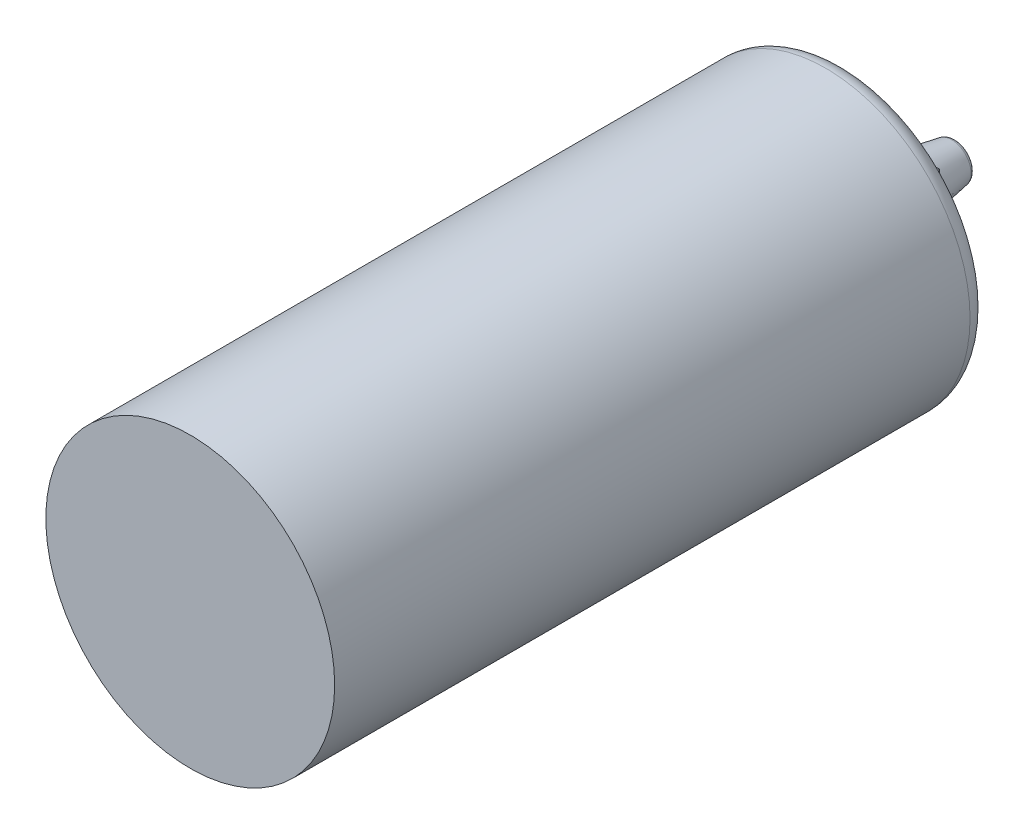
ISO-10303-21;
HEADER;
FILE_DESCRIPTION(('STEP AP214'),'2;1');
FILE_NAME('part.step','',(''),(''),'','','');
FILE_SCHEMA(('AUTOMOTIVE_DESIGN { 1 0 10303 214 1 1 1 1 }'));
ENDSEC;
DATA;
#1=APPLICATION_CONTEXT('core data for automotive mechanical design processes');
#2=APPLICATION_PROTOCOL_DEFINITION('international standard','automotive_design',2000,#1);
#3=PRODUCT_CONTEXT('',#1,'mechanical');
#4=PRODUCT('Part','Part','',(#3));
#5=PRODUCT_RELATED_PRODUCT_CATEGORY('part','',(#4));
#6=PRODUCT_DEFINITION_FORMATION('','',#4);
#7=PRODUCT_DEFINITION_CONTEXT('part definition',#1,'design');
#8=PRODUCT_DEFINITION('design','',#6,#7);
#9=PRODUCT_DEFINITION_SHAPE('','',#8);
#10=(LENGTH_UNIT() NAMED_UNIT(*) SI_UNIT(.MILLI.,.METRE.));
#11=(NAMED_UNIT(*) PLANE_ANGLE_UNIT() SI_UNIT($,.RADIAN.));
#12=(NAMED_UNIT(*) SI_UNIT($,.STERADIAN.) SOLID_ANGLE_UNIT());
#13=UNCERTAINTY_MEASURE_WITH_UNIT(LENGTH_MEASURE(1.E-05),#10,'distance_accuracy_value','');
#14=(GEOMETRIC_REPRESENTATION_CONTEXT(3) GLOBAL_UNCERTAINTY_ASSIGNED_CONTEXT((#13)) GLOBAL_UNIT_ASSIGNED_CONTEXT((#10,
#11,#12)) REPRESENTATION_CONTEXT('',''));
#15=CARTESIAN_POINT('',(0.,0.,0.));
#16=DIRECTION('',(0.,0.,1.));
#17=DIRECTION('',(1.,0.,0.));
#18=AXIS2_PLACEMENT_3D('',#15,#16,#17);
#19=CARTESIAN_POINT('',(0.,0.,-1.27));
#20=DIRECTION('',(0.,0.,1.));
#21=DIRECTION('',(1.,0.,0.));
#22=AXIS2_PLACEMENT_3D('',#19,#20,#21);
#23=PLANE('',#22);
#24=CARTESIAN_POINT('',(5.715,-5.715,-1.27));
#25=DIRECTION('',(0.,0.,1.));
#26=DIRECTION('',(1.,0.,0.));
#27=AXIS2_PLACEMENT_3D('',#24,#25,#26);
#28=CIRCLE('',#27,3.81);
#29=CARTESIAN_POINT('',(9.525,-5.715,-1.27));
#30=VERTEX_POINT('',#29);
#31=EDGE_CURVE('E146',#30,#30,#28,.F.);
#32=ORIENTED_EDGE('',*,*,#31,.F.);
#33=EDGE_LOOP('',(#32));
#34=FACE_BOUND('',#33,.T.);
#35=CARTESIAN_POINT('',(5.715,5.715,-1.27));
#36=DIRECTION('',(0.,0.,1.));
#37=DIRECTION('',(1.,0.,0.));
#38=AXIS2_PLACEMENT_3D('',#35,#36,#37);
#39=CIRCLE('',#38,3.81);
#40=CARTESIAN_POINT('',(9.525,5.715,-1.27));
#41=VERTEX_POINT('',#40);
#42=EDGE_CURVE('E140',#41,#41,#39,.F.);
#43=ORIENTED_EDGE('',*,*,#42,.F.);
#44=EDGE_LOOP('',(#43));
#45=FACE_BOUND('',#44,.T.);
#46=DIRECTION('',(0.,-1.,0.));
#47=VECTOR('',#46,1.);
#48=CARTESIAN_POINT('',(-11.2060647345003,0.,-1.27));
#49=LINE('',#48,#47);
#50=CARTESIAN_POINT('',(-11.2060647345003,-11.2060647345002,-1.27));
#51=VERTEX_POINT('',#50);
#52=CARTESIAN_POINT('',(-11.2060647345003,11.2060647345003,-1.27));
#53=VERTEX_POINT('',#52);
#54=EDGE_CURVE('E111',#51,#53,#49,.F.);
#55=ORIENTED_EDGE('',*,*,#54,.T.);
#56=DIRECTION('',(-1.,0.,0.));
#57=VECTOR('',#56,1.);
#58=CARTESIAN_POINT('',(0.,11.2060647345003,-1.27));
#59=LINE('',#58,#57);
#60=CARTESIAN_POINT('',(11.2060647345002,11.2060647345003,-1.27));
#61=VERTEX_POINT('',#60);
#62=EDGE_CURVE('E127',#53,#61,#59,.F.);
#63=ORIENTED_EDGE('',*,*,#62,.T.);
#64=DIRECTION('',(0.,1.,0.));
#65=VECTOR('',#64,1.);
#66=CARTESIAN_POINT('',(11.2060647345002,0.,-1.27));
#67=LINE('',#66,#65);
#68=CARTESIAN_POINT('',(11.2060647345002,-11.2060647345002,-1.27));
#69=VERTEX_POINT('',#68);
#70=EDGE_CURVE('E129',#61,#69,#67,.F.);
#71=ORIENTED_EDGE('',*,*,#70,.T.);
#72=DIRECTION('',(1.,0.,0.));
#73=VECTOR('',#72,1.);
#74=CARTESIAN_POINT('',(0.,-11.2060647345002,-1.27));
#75=LINE('',#74,#73);
#76=EDGE_CURVE('E120',#69,#51,#75,.F.);
#77=ORIENTED_EDGE('',*,*,#76,.T.);
#78=EDGE_LOOP('',(#55,#63,#71,#77));
#79=FACE_BOUND('',#78,.T.);
#80=CARTESIAN_POINT('',(-5.715,5.715,-1.27));
#81=DIRECTION('',(0.,0.,1.));
#82=DIRECTION('',(1.,0.,0.));
#83=AXIS2_PLACEMENT_3D('',#80,#81,#82);
#84=CIRCLE('',#83,3.81);
#85=CARTESIAN_POINT('',(-1.905,5.715,-1.27));
#86=VERTEX_POINT('',#85);
#87=EDGE_CURVE('E143',#86,#86,#84,.F.);
#88=ORIENTED_EDGE('',*,*,#87,.F.);
#89=EDGE_LOOP('',(#88));
#90=FACE_BOUND('',#89,.T.);
#91=CARTESIAN_POINT('',(-5.715,-5.715,-1.27));
#92=DIRECTION('',(0.,0.,1.));
#93=DIRECTION('',(1.,0.,0.));
#94=AXIS2_PLACEMENT_3D('',#91,#92,#93);
#95=CIRCLE('',#94,3.81);
#96=CARTESIAN_POINT('',(-1.905,-5.715,-1.27));
#97=VERTEX_POINT('',#96);
#98=EDGE_CURVE('E149',#97,#97,#95,.F.);
#99=ORIENTED_EDGE('',*,*,#98,.F.);
#100=EDGE_LOOP('',(#99));
#101=FACE_BOUND('',#100,.T.);
#102=ADVANCED_FACE('F34',(#34,#45,#79,#90,#101),#23,.F.);
#103=CARTESIAN_POINT('',(0.,0.,0.));
#104=DIRECTION('',(0.,0.,1.));
#105=DIRECTION('',(1.,0.,0.));
#106=AXIS2_PLACEMENT_3D('',#103,#104,#105);
#107=PLANE('',#106);
#108=CARTESIAN_POINT('',(0.,0.,0.));
#109=DIRECTION('',(0.,0.,1.));
#110=DIRECTION('',(1.,0.,0.));
#111=AXIS2_PLACEMENT_3D('',#108,#109,#110);
#112=CIRCLE('',#111,16.51);
#113=CARTESIAN_POINT('',(16.51,0.,0.));
#114=VERTEX_POINT('',#113);
#115=EDGE_CURVE('E137',#114,#114,#112,.F.);
#116=ORIENTED_EDGE('',*,*,#115,.T.);
#117=EDGE_LOOP('',(#116));
#118=FACE_BOUND('',#117,.T.);
#119=DIRECTION('',(0.,1.,0.));
#120=VECTOR('',#119,1.);
#121=CARTESIAN_POINT('',(-11.43,-11.43,0.));
#122=LINE('',#121,#120);
#123=CARTESIAN_POINT('',(-11.43,-11.43,0.));
#124=VERTEX_POINT('',#123);
#125=CARTESIAN_POINT('',(-11.43,11.43,0.));
#126=VERTEX_POINT('',#125);
#127=EDGE_CURVE('E103',#124,#126,#122,.T.);
#128=ORIENTED_EDGE('',*,*,#127,.F.);
#129=DIRECTION('',(-1.,0.,0.));
#130=VECTOR('',#129,1.);
#131=CARTESIAN_POINT('',(11.43,-11.43,0.));
#132=LINE('',#131,#130);
#133=CARTESIAN_POINT('',(11.43,-11.43,0.));
#134=VERTEX_POINT('',#133);
#135=EDGE_CURVE('E108',#134,#124,#132,.T.);
#136=ORIENTED_EDGE('',*,*,#135,.F.);
#137=DIRECTION('',(0.,-1.,0.));
#138=VECTOR('',#137,1.);
#139=CARTESIAN_POINT('',(11.43,-11.43,0.));
#140=LINE('',#139,#138);
#141=CARTESIAN_POINT('',(11.43,11.43,0.));
#142=VERTEX_POINT('',#141);
#143=EDGE_CURVE('E54',#142,#134,#140,.T.);
#144=ORIENTED_EDGE('',*,*,#143,.F.);
#145=DIRECTION('',(1.,0.,0.));
#146=VECTOR('',#145,1.);
#147=CARTESIAN_POINT('',(11.43,11.43,0.));
#148=LINE('',#147,#146);
#149=EDGE_CURVE('E49',#126,#142,#148,.T.);
#150=ORIENTED_EDGE('',*,*,#149,.F.);
#151=EDGE_LOOP('',(#128,#136,#144,#150));
#152=FACE_BOUND('',#151,.T.);
#153=ADVANCED_FACE('F189',(#118,#152),#107,.F.);
#154=CARTESIAN_POINT('',(0.,0.,86.36));
#155=DIRECTION('',(0.,0.,-1.));
#156=DIRECTION('',(-1.,0.,0.));
#157=AXIS2_PLACEMENT_3D('',#154,#155,#156);
#158=CYLINDRICAL_SURFACE('',#157,19.05);
#159=CARTESIAN_POINT('',(0.,0.,2.54));
#160=DIRECTION('',(0.,0.,1.));
#161=DIRECTION('',(1.,0.,0.));
#162=AXIS2_PLACEMENT_3D('',#159,#160,#161);
#163=CIRCLE('',#162,19.05);
#164=CARTESIAN_POINT('',(19.05,0.,2.54));
#165=VERTEX_POINT('',#164);
#166=EDGE_CURVE('E134',#165,#165,#163,.T.);
#167=ORIENTED_EDGE('',*,*,#166,.T.);
#168=EDGE_LOOP('',(#167));
#169=FACE_BOUND('',#168,.T.);
#170=CARTESIAN_POINT('',(0.,0.,86.36));
#171=DIRECTION('',(0.,0.,1.));
#172=DIRECTION('',(1.,0.,0.));
#173=AXIS2_PLACEMENT_3D('',#170,#171,#172);
#174=CIRCLE('',#173,19.05);
#175=CARTESIAN_POINT('',(19.05,0.,86.36));
#176=VERTEX_POINT('',#175);
#177=EDGE_CURVE('E114',#176,#176,#174,.T.);
#178=ORIENTED_EDGE('',*,*,#177,.F.);
#179=EDGE_LOOP('',(#178));
#180=FACE_BOUND('',#179,.T.);
#181=ADVANCED_FACE('F195',(#169,#180),#158,.T.);
#182=CARTESIAN_POINT('',(0.,0.,86.36));
#183=DIRECTION('',(0.,0.,1.));
#184=DIRECTION('',(1.,0.,0.));
#185=AXIS2_PLACEMENT_3D('',#182,#183,#184);
#186=PLANE('',#185);
#187=ORIENTED_EDGE('',*,*,#177,.T.);
#188=EDGE_LOOP('',(#187));
#189=FACE_BOUND('',#188,.T.);
#190=ADVANCED_FACE('F208',(#189),#186,.T.);
#191=CARTESIAN_POINT('',(-11.43,-11.43,0.));
#192=DIRECTION('',(-0.984807753012208,0.,-0.173648177666931));
#193=DIRECTION('',(-0.173648177666931,0.,0.984807753012208));
#194=AXIS2_PLACEMENT_3D('',#191,#192,#193);
#195=PLANE('',#194);
#196=ORIENTED_EDGE('',*,*,#127,.T.);
#197=DIRECTION('',(-0.171087869746036,0.171087869746036,0.970287525247814));
#198=VECTOR('',#197,1.);
#199=CARTESIAN_POINT('',(-10.760863587277,10.760863587277,-3.79486117232042));
#200=LINE('',#199,#198);
#201=EDGE_CURVE('E112',#53,#126,#200,.T.);
#202=ORIENTED_EDGE('',*,*,#201,.F.);
#203=ORIENTED_EDGE('',*,*,#54,.F.);
#204=DIRECTION('',(-0.171087869746036,-0.171087869746036,0.970287525247814));
#205=VECTOR('',#204,1.);
#206=CARTESIAN_POINT('',(-11.43,-11.43,0.));
#207=LINE('',#206,#205);
#208=EDGE_CURVE('E116',#51,#124,#207,.T.);
#209=ORIENTED_EDGE('',*,*,#208,.T.);
#210=EDGE_LOOP('',(#196,#202,#203,#209));
#211=FACE_BOUND('',#210,.T.);
#212=ADVANCED_FACE('F204',(#211),#195,.T.);
#213=CARTESIAN_POINT('',(11.43,11.43,0.));
#214=DIRECTION('',(0.,0.984807753012208,-0.173648177666931));
#215=DIRECTION('',(0.,0.173648177666931,0.984807753012208));
#216=AXIS2_PLACEMENT_3D('',#213,#214,#215);
#217=PLANE('',#216);
#218=ORIENTED_EDGE('',*,*,#149,.T.);
#219=DIRECTION('',(0.171087869746036,0.171087869746036,0.970287525247814));
#220=VECTOR('',#219,1.);
#221=CARTESIAN_POINT('',(10.7608635872769,10.760863587277,-3.79486117232042));
#222=LINE('',#221,#220);
#223=EDGE_CURVE('E115',#61,#142,#222,.T.);
#224=ORIENTED_EDGE('',*,*,#223,.F.);
#225=ORIENTED_EDGE('',*,*,#62,.F.);
#226=ORIENTED_EDGE('',*,*,#201,.T.);
#227=EDGE_LOOP('',(#218,#224,#225,#226));
#228=FACE_BOUND('',#227,.T.);
#229=ADVANCED_FACE('F207',(#228),#217,.T.);
#230=CARTESIAN_POINT('',(11.43,-11.43,0.));
#231=DIRECTION('',(0.984807753012208,0.,-0.173648177666931));
#232=DIRECTION('',(-0.173648177666931,0.,-0.984807753012208));
#233=AXIS2_PLACEMENT_3D('',#230,#231,#232);
#234=PLANE('',#233);
#235=ORIENTED_EDGE('',*,*,#143,.T.);
#236=DIRECTION('',(0.171087869746036,-0.171087869746036,0.970287525247814));
#237=VECTOR('',#236,1.);
#238=CARTESIAN_POINT('',(11.43,-11.43,0.));
#239=LINE('',#238,#237);
#240=EDGE_CURVE('E119',#69,#134,#239,.T.);
#241=ORIENTED_EDGE('',*,*,#240,.F.);
#242=ORIENTED_EDGE('',*,*,#70,.F.);
#243=ORIENTED_EDGE('',*,*,#223,.T.);
#244=EDGE_LOOP('',(#235,#241,#242,#243));
#245=FACE_BOUND('',#244,.T.);
#246=ADVANCED_FACE('F214',(#245),#234,.T.);
#247=CARTESIAN_POINT('',(11.43,-11.43,0.));
#248=DIRECTION('',(0.,-0.984807753012208,-0.173648177666931));
#249=DIRECTION('',(0.,0.173648177666931,-0.984807753012208));
#250=AXIS2_PLACEMENT_3D('',#247,#248,#249);
#251=PLANE('',#250);
#252=ORIENTED_EDGE('',*,*,#135,.T.);
#253=ORIENTED_EDGE('',*,*,#208,.F.);
#254=ORIENTED_EDGE('',*,*,#76,.F.);
#255=ORIENTED_EDGE('',*,*,#240,.T.);
#256=EDGE_LOOP('',(#252,#253,#254,#255));
#257=FACE_BOUND('',#256,.T.);
#258=ADVANCED_FACE('F210',(#257),#251,.T.);
#259=CARTESIAN_POINT('',(0.,0.,2.54));
#260=DIRECTION('',(0.,0.,1.));
#261=DIRECTION('',(1.,0.,0.));
#262=AXIS2_PLACEMENT_3D('',#259,#260,#261);
#263=TOROIDAL_SURFACE('',#262,16.51,2.54);
#264=ORIENTED_EDGE('',*,*,#115,.F.);
#265=EDGE_LOOP('',(#264));
#266=FACE_BOUND('',#265,.T.);
#267=ORIENTED_EDGE('',*,*,#166,.F.);
#268=EDGE_LOOP('',(#267));
#269=FACE_BOUND('',#268,.T.);
#270=ADVANCED_FACE('F213',(#266,#269),#263,.T.);
#271=CARTESIAN_POINT('',(5.715,5.715,-1.27));
#272=DIRECTION('',(0.,0.,1.));
#273=DIRECTION('',(-1.,0.,0.));
#274=AXIS2_PLACEMENT_3D('',#271,#272,#273);
#275=CONICAL_SURFACE('',#274,3.81,0.174532925199433);
#276=CARTESIAN_POINT('',(5.715,5.715,-8.3652665928185));
#277=DIRECTION('',(0.,0.,1.));
#278=DIRECTION('',(1.,0.,0.));
#279=AXIS2_PLACEMENT_3D('',#276,#277,#278);
#280=CIRCLE('',#279,2.55891306436667);
#281=CARTESIAN_POINT('',(8.27391306436667,5.715,-8.3652665928185));
#282=VERTEX_POINT('',#281);
#283=EDGE_CURVE('E11',#282,#282,#280,.T.);
#284=ORIENTED_EDGE('',*,*,#283,.T.);
#285=EDGE_LOOP('',(#284));
#286=FACE_BOUND('',#285,.T.);
#287=ORIENTED_EDGE('',*,*,#42,.T.);
#288=EDGE_LOOP('',(#287));
#289=FACE_BOUND('',#288,.T.);
#290=ADVANCED_FACE('F202',(#286,#289),#275,.T.);
#291=CARTESIAN_POINT('',(5.715,5.715,-8.89));
#292=DIRECTION('',(0.,0.,-1.));
#293=DIRECTION('',(-1.,0.,0.));
#294=AXIS2_PLACEMENT_3D('',#291,#292,#293);
#295=PLANE('',#294);
#296=CARTESIAN_POINT('',(5.715,5.715,-8.89));
#297=DIRECTION('',(0.,0.,-1.));
#298=DIRECTION('',(-1.,0.,0.));
#299=AXIS2_PLACEMENT_3D('',#296,#297,#298);
#300=CIRCLE('',#299,1.27);
#301=CARTESIAN_POINT('',(4.445,5.715,-8.89));
#302=VERTEX_POINT('',#301);
#303=EDGE_CURVE('E100',#302,#302,#300,.T.);
#304=ORIENTED_EDGE('',*,*,#303,.F.);
#305=EDGE_LOOP('',(#304));
#306=FACE_BOUND('',#305,.T.);
#307=CARTESIAN_POINT('',(5.715,5.715,-8.89));
#308=DIRECTION('',(0.,0.,-1.));
#309=DIRECTION('',(-1.,0.,0.));
#310=AXIS2_PLACEMENT_3D('',#307,#308,#309);
#311=CIRCLE('',#310,1.93356014120392);
#312=CARTESIAN_POINT('',(3.78143985879608,5.715,-8.89));
#313=VERTEX_POINT('',#312);
#314=EDGE_CURVE('E42',#313,#313,#311,.T.);
#315=ORIENTED_EDGE('',*,*,#314,.T.);
#316=EDGE_LOOP('',(#315));
#317=FACE_BOUND('',#316,.T.);
#318=ADVANCED_FACE('F172',(#306,#317),#295,.T.);
#319=CARTESIAN_POINT('',(-5.715,5.715,-1.27));
#320=DIRECTION('',(0.,0.,1.));
#321=DIRECTION('',(-1.,0.,0.));
#322=AXIS2_PLACEMENT_3D('',#319,#320,#321);
#323=CONICAL_SURFACE('',#322,3.81,0.174532925199433);
#324=CARTESIAN_POINT('',(-5.715,5.715,-8.3652665928185));
#325=DIRECTION('',(0.,0.,1.));
#326=DIRECTION('',(1.,0.,0.));
#327=AXIS2_PLACEMENT_3D('',#324,#325,#326);
#328=CIRCLE('',#327,2.55891306436667);
#329=CARTESIAN_POINT('',(-3.15608693563333,5.715,-8.3652665928185));
#330=VERTEX_POINT('',#329);
#331=EDGE_CURVE('E167',#330,#330,#328,.T.);
#332=ORIENTED_EDGE('',*,*,#331,.T.);
#333=EDGE_LOOP('',(#332));
#334=FACE_BOUND('',#333,.T.);
#335=ORIENTED_EDGE('',*,*,#87,.T.);
#336=EDGE_LOOP('',(#335));
#337=FACE_BOUND('',#336,.T.);
#338=ADVANCED_FACE('F266',(#334,#337),#323,.T.);
#339=CARTESIAN_POINT('',(-5.715,5.715,-8.89));
#340=DIRECTION('',(0.,0.,-1.));
#341=DIRECTION('',(-1.,0.,0.));
#342=AXIS2_PLACEMENT_3D('',#339,#340,#341);
#343=PLANE('',#342);
#344=CARTESIAN_POINT('',(-5.715,5.715,-8.89));
#345=DIRECTION('',(0.,0.,-1.));
#346=DIRECTION('',(-1.,0.,0.));
#347=AXIS2_PLACEMENT_3D('',#344,#345,#346);
#348=CIRCLE('',#347,1.27);
#349=CARTESIAN_POINT('',(-6.985,5.715,-8.89));
#350=VERTEX_POINT('',#349);
#351=EDGE_CURVE('E95',#350,#350,#348,.T.);
#352=ORIENTED_EDGE('',*,*,#351,.F.);
#353=EDGE_LOOP('',(#352));
#354=FACE_BOUND('',#353,.T.);
#355=CARTESIAN_POINT('',(-5.715,5.715,-8.89));
#356=DIRECTION('',(0.,0.,-1.));
#357=DIRECTION('',(-1.,0.,0.));
#358=AXIS2_PLACEMENT_3D('',#355,#356,#357);
#359=CIRCLE('',#358,1.93356014120392);
#360=CARTESIAN_POINT('',(-7.64856014120392,5.715,-8.89));
#361=VERTEX_POINT('',#360);
#362=EDGE_CURVE('E164',#361,#361,#359,.T.);
#363=ORIENTED_EDGE('',*,*,#362,.T.);
#364=EDGE_LOOP('',(#363));
#365=FACE_BOUND('',#364,.T.);
#366=ADVANCED_FACE('F262',(#354,#365),#343,.T.);
#367=CARTESIAN_POINT('',(5.715,-5.715,-1.27));
#368=DIRECTION('',(0.,0.,1.));
#369=DIRECTION('',(-1.,0.,0.));
#370=AXIS2_PLACEMENT_3D('',#367,#368,#369);
#371=CONICAL_SURFACE('',#370,3.81,0.174532925199433);
#372=CARTESIAN_POINT('',(5.715,-5.715,-8.3652665928185));
#373=DIRECTION('',(0.,0.,1.));
#374=DIRECTION('',(1.,0.,0.));
#375=AXIS2_PLACEMENT_3D('',#372,#373,#374);
#376=CIRCLE('',#375,2.55891306436667);
#377=CARTESIAN_POINT('',(8.27391306436667,-5.715,-8.3652665928185));
#378=VERTEX_POINT('',#377);
#379=EDGE_CURVE('E155',#378,#378,#376,.T.);
#380=ORIENTED_EDGE('',*,*,#379,.T.);
#381=EDGE_LOOP('',(#380));
#382=FACE_BOUND('',#381,.T.);
#383=ORIENTED_EDGE('',*,*,#31,.T.);
#384=EDGE_LOOP('',(#383));
#385=FACE_BOUND('',#384,.T.);
#386=ADVANCED_FACE('F259',(#382,#385),#371,.T.);
#387=CARTESIAN_POINT('',(5.715,-5.715,-8.89));
#388=DIRECTION('',(0.,0.,-1.));
#389=DIRECTION('',(-1.,0.,0.));
#390=AXIS2_PLACEMENT_3D('',#387,#388,#389);
#391=PLANE('',#390);
#392=CARTESIAN_POINT('',(5.715,-5.715,-8.89));
#393=DIRECTION('',(0.,0.,-1.));
#394=DIRECTION('',(-1.,0.,0.));
#395=AXIS2_PLACEMENT_3D('',#392,#393,#394);
#396=CIRCLE('',#395,1.27);
#397=CARTESIAN_POINT('',(4.445,-5.715,-8.89));
#398=VERTEX_POINT('',#397);
#399=EDGE_CURVE('E90',#398,#398,#396,.T.);
#400=ORIENTED_EDGE('',*,*,#399,.F.);
#401=EDGE_LOOP('',(#400));
#402=FACE_BOUND('',#401,.T.);
#403=CARTESIAN_POINT('',(5.715,-5.715,-8.89));
#404=DIRECTION('',(0.,0.,-1.));
#405=DIRECTION('',(-1.,0.,0.));
#406=AXIS2_PLACEMENT_3D('',#403,#404,#405);
#407=CIRCLE('',#406,1.93356014120392);
#408=CARTESIAN_POINT('',(3.78143985879608,-5.715,-8.89));
#409=VERTEX_POINT('',#408);
#410=EDGE_CURVE('E152',#409,#409,#407,.T.);
#411=ORIENTED_EDGE('',*,*,#410,.T.);
#412=EDGE_LOOP('',(#411));
#413=FACE_BOUND('',#412,.T.);
#414=ADVANCED_FACE('F251',(#402,#413),#391,.T.);
#415=CARTESIAN_POINT('',(-5.715,-5.715,-1.27));
#416=DIRECTION('',(0.,0.,1.));
#417=DIRECTION('',(-1.,0.,0.));
#418=AXIS2_PLACEMENT_3D('',#415,#416,#417);
#419=CONICAL_SURFACE('',#418,3.81,0.174532925199433);
#420=CARTESIAN_POINT('',(-5.715,-5.715,-8.3652665928185));
#421=DIRECTION('',(0.,0.,1.));
#422=DIRECTION('',(1.,0.,0.));
#423=AXIS2_PLACEMENT_3D('',#420,#421,#422);
#424=CIRCLE('',#423,2.55891306436667);
#425=CARTESIAN_POINT('',(-3.15608693563333,-5.715,-8.3652665928185));
#426=VERTEX_POINT('',#425);
#427=EDGE_CURVE('E161',#426,#426,#424,.T.);
#428=ORIENTED_EDGE('',*,*,#427,.T.);
#429=EDGE_LOOP('',(#428));
#430=FACE_BOUND('',#429,.T.);
#431=ORIENTED_EDGE('',*,*,#98,.T.);
#432=EDGE_LOOP('',(#431));
#433=FACE_BOUND('',#432,.T.);
#434=ADVANCED_FACE('F245',(#430,#433),#419,.T.);
#435=CARTESIAN_POINT('',(-5.715,-5.715,-8.89));
#436=DIRECTION('',(0.,0.,-1.));
#437=DIRECTION('',(-1.,0.,0.));
#438=AXIS2_PLACEMENT_3D('',#435,#436,#437);
#439=PLANE('',#438);
#440=CARTESIAN_POINT('',(-5.715,-5.715,-8.89));
#441=DIRECTION('',(0.,0.,-1.));
#442=DIRECTION('',(-1.,0.,0.));
#443=AXIS2_PLACEMENT_3D('',#440,#441,#442);
#444=CIRCLE('',#443,1.27);
#445=CARTESIAN_POINT('',(-6.985,-5.715,-8.89));
#446=VERTEX_POINT('',#445);
#447=EDGE_CURVE('E92',#446,#446,#444,.T.);
#448=ORIENTED_EDGE('',*,*,#447,.F.);
#449=EDGE_LOOP('',(#448));
#450=FACE_BOUND('',#449,.T.);
#451=CARTESIAN_POINT('',(-5.715,-5.715,-8.89));
#452=DIRECTION('',(0.,0.,-1.));
#453=DIRECTION('',(-1.,0.,0.));
#454=AXIS2_PLACEMENT_3D('',#451,#452,#453);
#455=CIRCLE('',#454,1.93356014120392);
#456=CARTESIAN_POINT('',(-7.64856014120392,-5.715,-8.89));
#457=VERTEX_POINT('',#456);
#458=EDGE_CURVE('E158',#457,#457,#455,.T.);
#459=ORIENTED_EDGE('',*,*,#458,.T.);
#460=EDGE_LOOP('',(#459));
#461=FACE_BOUND('',#460,.T.);
#462=ADVANCED_FACE('F234',(#450,#461),#439,.T.);
#463=CARTESIAN_POINT('',(5.715,-5.715,-8.255));
#464=DIRECTION('',(0.,0.,-1.));
#465=DIRECTION('',(-1.,0.,0.));
#466=AXIS2_PLACEMENT_3D('',#463,#464,#465);
#467=TOROIDAL_SURFACE('',#466,1.93356014120392,0.635);
#468=ORIENTED_EDGE('',*,*,#379,.F.);
#469=EDGE_LOOP('',(#468));
#470=FACE_BOUND('',#469,.T.);
#471=ORIENTED_EDGE('',*,*,#410,.F.);
#472=EDGE_LOOP('',(#471));
#473=FACE_BOUND('',#472,.T.);
#474=ADVANCED_FACE('F231',(#470,#473),#467,.T.);
#475=CARTESIAN_POINT('',(-5.715,-5.715,-8.255));
#476=DIRECTION('',(0.,0.,-1.));
#477=DIRECTION('',(-1.,0.,0.));
#478=AXIS2_PLACEMENT_3D('',#475,#476,#477);
#479=TOROIDAL_SURFACE('',#478,1.93356014120392,0.635);
#480=ORIENTED_EDGE('',*,*,#427,.F.);
#481=EDGE_LOOP('',(#480));
#482=FACE_BOUND('',#481,.T.);
#483=ORIENTED_EDGE('',*,*,#458,.F.);
#484=EDGE_LOOP('',(#483));
#485=FACE_BOUND('',#484,.T.);
#486=ADVANCED_FACE('F185',(#482,#485),#479,.T.);
#487=CARTESIAN_POINT('',(-5.715,5.715,-8.255));
#488=DIRECTION('',(0.,0.,-1.));
#489=DIRECTION('',(-1.,0.,0.));
#490=AXIS2_PLACEMENT_3D('',#487,#488,#489);
#491=TOROIDAL_SURFACE('',#490,1.93356014120392,0.635);
#492=ORIENTED_EDGE('',*,*,#331,.F.);
#493=EDGE_LOOP('',(#492));
#494=FACE_BOUND('',#493,.T.);
#495=ORIENTED_EDGE('',*,*,#362,.F.);
#496=EDGE_LOOP('',(#495));
#497=FACE_BOUND('',#496,.T.);
#498=ADVANCED_FACE('F176',(#494,#497),#491,.T.);
#499=CARTESIAN_POINT('',(5.715,5.715,-8.255));
#500=DIRECTION('',(0.,0.,-1.));
#501=DIRECTION('',(-1.,0.,0.));
#502=AXIS2_PLACEMENT_3D('',#499,#500,#501);
#503=TOROIDAL_SURFACE('',#502,1.93356014120392,0.635);
#504=ORIENTED_EDGE('',*,*,#283,.F.);
#505=EDGE_LOOP('',(#504));
#506=FACE_BOUND('',#505,.T.);
#507=ORIENTED_EDGE('',*,*,#314,.F.);
#508=EDGE_LOOP('',(#507));
#509=FACE_BOUND('',#508,.T.);
#510=ADVANCED_FACE('F36',(#506,#509),#503,.T.);
#511=CARTESIAN_POINT('',(5.715,5.715,-8.89));
#512=DIRECTION('',(0.,0.,-1.));
#513=DIRECTION('',(-1.,0.,0.));
#514=AXIS2_PLACEMENT_3D('',#511,#512,#513);
#515=CONICAL_SURFACE('',#514,1.27,0.0872664625997167);
#516=CARTESIAN_POINT('',(5.715,5.715,5.62616642450688));
#517=VERTEX_POINT('',#516);
#518=VERTEX_LOOP('',#517);
#519=FACE_BOUND('',#518,.T.);
#520=ORIENTED_EDGE('',*,*,#303,.T.);
#521=EDGE_LOOP('',(#520));
#522=FACE_BOUND('',#521,.T.);
#523=ADVANCED_FACE('F175',(#519,#522),#515,.F.);
#524=CARTESIAN_POINT('',(-5.715,5.715,-8.89));
#525=DIRECTION('',(0.,0.,-1.));
#526=DIRECTION('',(-1.,0.,0.));
#527=AXIS2_PLACEMENT_3D('',#524,#525,#526);
#528=CONICAL_SURFACE('',#527,1.27,0.0872664625997167);
#529=CARTESIAN_POINT('',(-5.715,5.715,5.62616642450688));
#530=VERTEX_POINT('',#529);
#531=VERTEX_LOOP('',#530);
#532=FACE_BOUND('',#531,.T.);
#533=ORIENTED_EDGE('',*,*,#351,.T.);
#534=EDGE_LOOP('',(#533));
#535=FACE_BOUND('',#534,.T.);
#536=ADVANCED_FACE('F182',(#532,#535),#528,.F.);
#537=CARTESIAN_POINT('',(-5.715,-5.715,-8.89));
#538=DIRECTION('',(0.,0.,-1.));
#539=DIRECTION('',(-1.,0.,0.));
#540=AXIS2_PLACEMENT_3D('',#537,#538,#539);
#541=CONICAL_SURFACE('',#540,1.27,0.0872664625997167);
#542=CARTESIAN_POINT('',(-5.715,-5.715,5.62616642450688));
#543=VERTEX_POINT('',#542);
#544=VERTEX_LOOP('',#543);
#545=FACE_BOUND('',#544,.T.);
#546=ORIENTED_EDGE('',*,*,#447,.T.);
#547=EDGE_LOOP('',(#546));
#548=FACE_BOUND('',#547,.T.);
#549=ADVANCED_FACE('F86',(#545,#548),#541,.F.);
#550=CARTESIAN_POINT('',(5.715,-5.715,-8.89));
#551=DIRECTION('',(0.,0.,-1.));
#552=DIRECTION('',(-1.,0.,0.));
#553=AXIS2_PLACEMENT_3D('',#550,#551,#552);
#554=CONICAL_SURFACE('',#553,1.27,0.0872664625997167);
#555=CARTESIAN_POINT('',(5.715,-5.715,5.62616642450688));
#556=VERTEX_POINT('',#555);
#557=VERTEX_LOOP('',#556);
#558=FACE_BOUND('',#557,.T.);
#559=ORIENTED_EDGE('',*,*,#399,.T.);
#560=EDGE_LOOP('',(#559));
#561=FACE_BOUND('',#560,.T.);
#562=ADVANCED_FACE('F83',(#558,#561),#554,.F.);
#563=CLOSED_SHELL('',(#102,#153,#181,#190,#212,#229,#246,#258,#270,#290,#318,#338,#366,#386,
#414,#434,#462,#474,#486,#498,#510,#523,#536,#549,#562));
#564=MANIFOLD_SOLID_BREP('B2',#563);
#565=ADVANCED_BREP_SHAPE_REPRESENTATION('',(#18,#564),#14);
#566=SHAPE_DEFINITION_REPRESENTATION(#9,#565);
ENDSEC;
END-ISO-10303-21;
